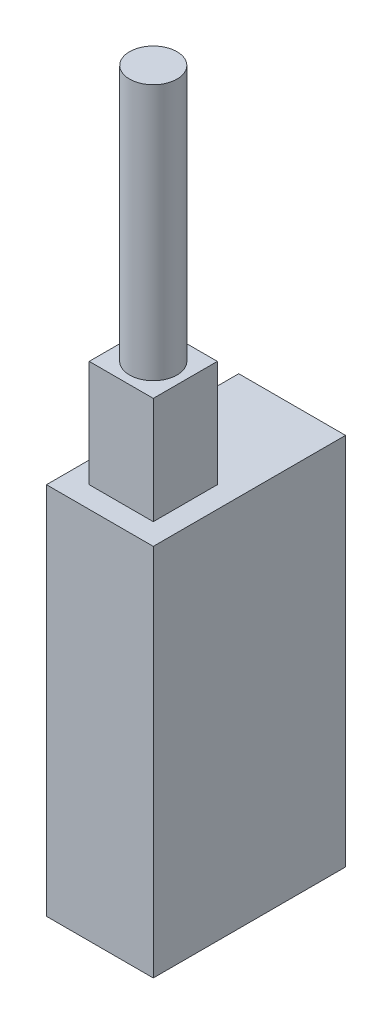
ISO-10303-21;
HEADER;
FILE_DESCRIPTION(('STEP AP214'),'2;1');
FILE_NAME('part.step','',(''),(''),'','','');
FILE_SCHEMA(('AUTOMOTIVE_DESIGN { 1 0 10303 214 1 1 1 1 }'));
ENDSEC;
DATA;
#1=APPLICATION_CONTEXT('core data for automotive mechanical design processes');
#2=APPLICATION_PROTOCOL_DEFINITION('international standard','automotive_design',2000,#1);
#3=PRODUCT_CONTEXT('',#1,'mechanical');
#4=PRODUCT('Part','Part','',(#3));
#5=PRODUCT_RELATED_PRODUCT_CATEGORY('part','',(#4));
#6=PRODUCT_DEFINITION_FORMATION('','',#4);
#7=PRODUCT_DEFINITION_CONTEXT('part definition',#1,'design');
#8=PRODUCT_DEFINITION('design','',#6,#7);
#9=PRODUCT_DEFINITION_SHAPE('','',#8);
#10=(LENGTH_UNIT() NAMED_UNIT(*) SI_UNIT(.MILLI.,.METRE.));
#11=(NAMED_UNIT(*) PLANE_ANGLE_UNIT() SI_UNIT($,.RADIAN.));
#12=(NAMED_UNIT(*) SI_UNIT($,.STERADIAN.) SOLID_ANGLE_UNIT());
#13=UNCERTAINTY_MEASURE_WITH_UNIT(LENGTH_MEASURE(1.E-05),#10,'distance_accuracy_value','');
#14=(GEOMETRIC_REPRESENTATION_CONTEXT(3) GLOBAL_UNCERTAINTY_ASSIGNED_CONTEXT((#13)) GLOBAL_UNIT_ASSIGNED_CONTEXT((#10,
#11,#12)) REPRESENTATION_CONTEXT('',''));
#15=CARTESIAN_POINT('',(0.,0.,0.));
#16=DIRECTION('',(0.,0.,1.));
#17=DIRECTION('',(1.,0.,0.));
#18=AXIS2_PLACEMENT_3D('',#15,#16,#17);
#19=CARTESIAN_POINT('',(0.,70.,0.));
#20=DIRECTION('',(0.,-1.,0.));
#21=DIRECTION('',(0.,0.,-1.));
#22=AXIS2_PLACEMENT_3D('',#19,#20,#21);
#23=PLANE('',#22);
#24=DIRECTION('',(0.,0.,-1.));
#25=VECTOR('',#24,1.);
#26=CARTESIAN_POINT('',(10.,70.,18.));
#27=LINE('',#26,#25);
#28=CARTESIAN_POINT('',(10.,70.,18.));
#29=VERTEX_POINT('',#28);
#30=CARTESIAN_POINT('',(10.,70.,-18.));
#31=VERTEX_POINT('',#30);
#32=EDGE_CURVE('E130',#29,#31,#27,.T.);
#33=ORIENTED_EDGE('',*,*,#32,.T.);
#34=DIRECTION('',(-1.,0.,0.));
#35=VECTOR('',#34,1.);
#36=CARTESIAN_POINT('',(-10.,70.,-18.));
#37=LINE('',#36,#35);
#38=CARTESIAN_POINT('',(-10.,70.,-18.));
#39=VERTEX_POINT('',#38);
#40=EDGE_CURVE('E133',#31,#39,#37,.T.);
#41=ORIENTED_EDGE('',*,*,#40,.T.);
#42=DIRECTION('',(0.,0.,1.));
#43=VECTOR('',#42,1.);
#44=CARTESIAN_POINT('',(-10.,70.,18.));
#45=LINE('',#44,#43);
#46=CARTESIAN_POINT('',(-10.,70.,18.));
#47=VERTEX_POINT('',#46);
#48=EDGE_CURVE('E136',#39,#47,#45,.T.);
#49=ORIENTED_EDGE('',*,*,#48,.T.);
#50=DIRECTION('',(1.,0.,0.));
#51=VECTOR('',#50,1.);
#52=CARTESIAN_POINT('',(-10.,70.,18.));
#53=LINE('',#52,#51);
#54=EDGE_CURVE('E138',#47,#29,#53,.T.);
#55=ORIENTED_EDGE('',*,*,#54,.T.);
#56=EDGE_LOOP('',(#33,#41,#49,#55));
#57=FACE_BOUND('',#56,.T.);
#58=DIRECTION('',(0.,0.,-1.));
#59=VECTOR('',#58,1.);
#60=CARTESIAN_POINT('',(6.,70.,14.));
#61=LINE('',#60,#59);
#62=CARTESIAN_POINT('',(6.,70.,14.));
#63=VERTEX_POINT('',#62);
#64=CARTESIAN_POINT('',(6.,70.,2.));
#65=VERTEX_POINT('',#64);
#66=EDGE_CURVE('E120',#63,#65,#61,.T.);
#67=ORIENTED_EDGE('',*,*,#66,.F.);
#68=DIRECTION('',(1.,0.,0.));
#69=VECTOR('',#68,1.);
#70=CARTESIAN_POINT('',(-6.,70.,14.));
#71=LINE('',#70,#69);
#72=CARTESIAN_POINT('',(-6.,70.,14.));
#73=VERTEX_POINT('',#72);
#74=EDGE_CURVE('E117',#73,#63,#71,.T.);
#75=ORIENTED_EDGE('',*,*,#74,.F.);
#76=DIRECTION('',(0.,0.,1.));
#77=VECTOR('',#76,1.);
#78=CARTESIAN_POINT('',(-6.,70.,14.));
#79=LINE('',#78,#77);
#80=CARTESIAN_POINT('',(-6.,70.,2.));
#81=VERTEX_POINT('',#80);
#82=EDGE_CURVE('E55',#81,#73,#79,.T.);
#83=ORIENTED_EDGE('',*,*,#82,.F.);
#84=DIRECTION('',(-1.,0.,0.));
#85=VECTOR('',#84,1.);
#86=CARTESIAN_POINT('',(-6.,70.,2.));
#87=LINE('',#86,#85);
#88=EDGE_CURVE('E50',#65,#81,#87,.T.);
#89=ORIENTED_EDGE('',*,*,#88,.F.);
#90=EDGE_LOOP('',(#67,#75,#83,#89));
#91=FACE_BOUND('',#90,.T.);
#92=ADVANCED_FACE('F34',(#57,#91),#23,.F.);
#93=CARTESIAN_POINT('',(10.,70.,18.));
#94=DIRECTION('',(-1.,0.,0.));
#95=DIRECTION('',(0.,0.,1.));
#96=AXIS2_PLACEMENT_3D('',#93,#94,#95);
#97=PLANE('',#96);
#98=DIRECTION('',(0.,0.,-1.));
#99=VECTOR('',#98,1.);
#100=CARTESIAN_POINT('',(10.,0.,18.));
#101=LINE('',#100,#99);
#102=CARTESIAN_POINT('',(10.,0.,18.));
#103=VERTEX_POINT('',#102);
#104=CARTESIAN_POINT('',(10.,0.,-18.));
#105=VERTEX_POINT('',#104);
#106=EDGE_CURVE('E121',#103,#105,#101,.T.);
#107=ORIENTED_EDGE('',*,*,#106,.T.);
#108=DIRECTION('',(0.,-1.,0.));
#109=VECTOR('',#108,1.);
#110=CARTESIAN_POINT('',(10.,70.,-18.));
#111=LINE('',#110,#109);
#112=EDGE_CURVE('E38',#31,#105,#111,.T.);
#113=ORIENTED_EDGE('',*,*,#112,.F.);
#114=ORIENTED_EDGE('',*,*,#32,.F.);
#115=DIRECTION('',(0.,-1.,0.));
#116=VECTOR('',#115,1.);
#117=CARTESIAN_POINT('',(10.,70.,18.));
#118=LINE('',#117,#116);
#119=EDGE_CURVE('E139',#29,#103,#118,.T.);
#120=ORIENTED_EDGE('',*,*,#119,.T.);
#121=EDGE_LOOP('',(#107,#113,#114,#120));
#122=FACE_BOUND('',#121,.T.);
#123=ADVANCED_FACE('F36',(#122),#97,.F.);
#124=CARTESIAN_POINT('',(-10.,70.,-18.));
#125=DIRECTION('',(0.,0.,1.));
#126=DIRECTION('',(1.,0.,0.));
#127=AXIS2_PLACEMENT_3D('',#124,#125,#126);
#128=PLANE('',#127);
#129=DIRECTION('',(-1.,0.,0.));
#130=VECTOR('',#129,1.);
#131=CARTESIAN_POINT('',(-10.,0.,-18.));
#132=LINE('',#131,#130);
#133=CARTESIAN_POINT('',(-10.,0.,-18.));
#134=VERTEX_POINT('',#133);
#135=EDGE_CURVE('E124',#105,#134,#132,.T.);
#136=ORIENTED_EDGE('',*,*,#135,.T.);
#137=DIRECTION('',(0.,-1.,0.));
#138=VECTOR('',#137,1.);
#139=CARTESIAN_POINT('',(-10.,70.,-18.));
#140=LINE('',#139,#138);
#141=EDGE_CURVE('E149',#39,#134,#140,.T.);
#142=ORIENTED_EDGE('',*,*,#141,.F.);
#143=ORIENTED_EDGE('',*,*,#40,.F.);
#144=ORIENTED_EDGE('',*,*,#112,.T.);
#145=EDGE_LOOP('',(#136,#142,#143,#144));
#146=FACE_BOUND('',#145,.T.);
#147=ADVANCED_FACE('F158',(#146),#128,.F.);
#148=CARTESIAN_POINT('',(-10.,70.,18.));
#149=DIRECTION('',(1.,0.,0.));
#150=DIRECTION('',(0.,0.,-1.));
#151=AXIS2_PLACEMENT_3D('',#148,#149,#150);
#152=PLANE('',#151);
#153=DIRECTION('',(0.,0.,1.));
#154=VECTOR('',#153,1.);
#155=CARTESIAN_POINT('',(-10.,0.,18.));
#156=LINE('',#155,#154);
#157=CARTESIAN_POINT('',(-10.,0.,18.));
#158=VERTEX_POINT('',#157);
#159=EDGE_CURVE('E142',#134,#158,#156,.T.);
#160=ORIENTED_EDGE('',*,*,#159,.T.);
#161=DIRECTION('',(0.,-1.,0.));
#162=VECTOR('',#161,1.);
#163=CARTESIAN_POINT('',(-10.,70.,18.));
#164=LINE('',#163,#162);
#165=EDGE_CURVE('E147',#47,#158,#164,.T.);
#166=ORIENTED_EDGE('',*,*,#165,.F.);
#167=ORIENTED_EDGE('',*,*,#48,.F.);
#168=ORIENTED_EDGE('',*,*,#141,.T.);
#169=EDGE_LOOP('',(#160,#166,#167,#168));
#170=FACE_BOUND('',#169,.T.);
#171=ADVANCED_FACE('F167',(#170),#152,.F.);
#172=CARTESIAN_POINT('',(-10.,70.,18.));
#173=DIRECTION('',(0.,0.,-1.));
#174=DIRECTION('',(-1.,0.,0.));
#175=AXIS2_PLACEMENT_3D('',#172,#173,#174);
#176=PLANE('',#175);
#177=DIRECTION('',(1.,0.,0.));
#178=VECTOR('',#177,1.);
#179=CARTESIAN_POINT('',(-10.,0.,18.));
#180=LINE('',#179,#178);
#181=EDGE_CURVE('E134',#158,#103,#180,.T.);
#182=ORIENTED_EDGE('',*,*,#181,.T.);
#183=ORIENTED_EDGE('',*,*,#119,.F.);
#184=ORIENTED_EDGE('',*,*,#54,.F.);
#185=ORIENTED_EDGE('',*,*,#165,.T.);
#186=EDGE_LOOP('',(#182,#183,#184,#185));
#187=FACE_BOUND('',#186,.T.);
#188=ADVANCED_FACE('F170',(#187),#176,.F.);
#189=CARTESIAN_POINT('',(0.,0.,0.));
#190=DIRECTION('',(0.,-1.,0.));
#191=DIRECTION('',(0.,0.,-1.));
#192=AXIS2_PLACEMENT_3D('',#189,#190,#191);
#193=PLANE('',#192);
#194=ORIENTED_EDGE('',*,*,#106,.F.);
#195=ORIENTED_EDGE('',*,*,#181,.F.);
#196=ORIENTED_EDGE('',*,*,#159,.F.);
#197=ORIENTED_EDGE('',*,*,#135,.F.);
#198=EDGE_LOOP('',(#194,#195,#196,#197));
#199=FACE_BOUND('',#198,.T.);
#200=ADVANCED_FACE('F165',(#199),#193,.T.);
#201=CARTESIAN_POINT('',(6.,90.,14.));
#202=DIRECTION('',(-1.,0.,0.));
#203=DIRECTION('',(0.,0.,1.));
#204=AXIS2_PLACEMENT_3D('',#201,#202,#203);
#205=PLANE('',#204);
#206=ORIENTED_EDGE('',*,*,#66,.T.);
#207=DIRECTION('',(0.,-1.,0.));
#208=VECTOR('',#207,1.);
#209=CARTESIAN_POINT('',(6.,90.,2.));
#210=LINE('',#209,#208);
#211=CARTESIAN_POINT('',(6.,90.,2.));
#212=VERTEX_POINT('',#211);
#213=EDGE_CURVE('E101',#212,#65,#210,.T.);
#214=ORIENTED_EDGE('',*,*,#213,.F.);
#215=DIRECTION('',(0.,0.,-1.));
#216=VECTOR('',#215,1.);
#217=CARTESIAN_POINT('',(6.,90.,14.));
#218=LINE('',#217,#216);
#219=CARTESIAN_POINT('',(6.,90.,14.));
#220=VERTEX_POINT('',#219);
#221=EDGE_CURVE('E108',#220,#212,#218,.T.);
#222=ORIENTED_EDGE('',*,*,#221,.F.);
#223=DIRECTION('',(0.,-1.,0.));
#224=VECTOR('',#223,1.);
#225=CARTESIAN_POINT('',(6.,90.,14.));
#226=LINE('',#225,#224);
#227=EDGE_CURVE('E180',#220,#63,#226,.T.);
#228=ORIENTED_EDGE('',*,*,#227,.T.);
#229=EDGE_LOOP('',(#206,#214,#222,#228));
#230=FACE_BOUND('',#229,.T.);
#231=ADVANCED_FACE('F119',(#230),#205,.F.);
#232=CARTESIAN_POINT('',(-6.,90.,2.));
#233=DIRECTION('',(0.,0.,1.));
#234=DIRECTION('',(1.,0.,0.));
#235=AXIS2_PLACEMENT_3D('',#232,#233,#234);
#236=PLANE('',#235);
#237=ORIENTED_EDGE('',*,*,#88,.T.);
#238=DIRECTION('',(0.,-1.,0.));
#239=VECTOR('',#238,1.);
#240=CARTESIAN_POINT('',(-6.,90.,2.));
#241=LINE('',#240,#239);
#242=CARTESIAN_POINT('',(-6.,90.,2.));
#243=VERTEX_POINT('',#242);
#244=EDGE_CURVE('E104',#243,#81,#241,.T.);
#245=ORIENTED_EDGE('',*,*,#244,.F.);
#246=DIRECTION('',(-1.,0.,0.));
#247=VECTOR('',#246,1.);
#248=CARTESIAN_POINT('',(-6.,90.,2.));
#249=LINE('',#248,#247);
#250=EDGE_CURVE('E97',#212,#243,#249,.T.);
#251=ORIENTED_EDGE('',*,*,#250,.F.);
#252=ORIENTED_EDGE('',*,*,#213,.T.);
#253=EDGE_LOOP('',(#237,#245,#251,#252));
#254=FACE_BOUND('',#253,.T.);
#255=ADVANCED_FACE('F99',(#254),#236,.F.);
#256=CARTESIAN_POINT('',(-6.,90.,14.));
#257=DIRECTION('',(1.,0.,0.));
#258=DIRECTION('',(0.,0.,-1.));
#259=AXIS2_PLACEMENT_3D('',#256,#257,#258);
#260=PLANE('',#259);
#261=ORIENTED_EDGE('',*,*,#82,.T.);
#262=DIRECTION('',(0.,-1.,0.));
#263=VECTOR('',#262,1.);
#264=CARTESIAN_POINT('',(-6.,90.,14.));
#265=LINE('',#264,#263);
#266=CARTESIAN_POINT('',(-6.,90.,14.));
#267=VERTEX_POINT('',#266);
#268=EDGE_CURVE('E126',#267,#73,#265,.T.);
#269=ORIENTED_EDGE('',*,*,#268,.F.);
#270=DIRECTION('',(0.,0.,1.));
#271=VECTOR('',#270,1.);
#272=CARTESIAN_POINT('',(-6.,90.,14.));
#273=LINE('',#272,#271);
#274=EDGE_CURVE('E107',#243,#267,#273,.T.);
#275=ORIENTED_EDGE('',*,*,#274,.F.);
#276=ORIENTED_EDGE('',*,*,#244,.T.);
#277=EDGE_LOOP('',(#261,#269,#275,#276));
#278=FACE_BOUND('',#277,.T.);
#279=ADVANCED_FACE('F205',(#278),#260,.F.);
#280=CARTESIAN_POINT('',(-6.,90.,14.));
#281=DIRECTION('',(0.,0.,-1.));
#282=DIRECTION('',(-1.,0.,0.));
#283=AXIS2_PLACEMENT_3D('',#280,#281,#282);
#284=PLANE('',#283);
#285=ORIENTED_EDGE('',*,*,#74,.T.);
#286=ORIENTED_EDGE('',*,*,#227,.F.);
#287=DIRECTION('',(1.,0.,0.));
#288=VECTOR('',#287,1.);
#289=CARTESIAN_POINT('',(-6.,90.,14.));
#290=LINE('',#289,#288);
#291=EDGE_CURVE('E113',#267,#220,#290,.T.);
#292=ORIENTED_EDGE('',*,*,#291,.F.);
#293=ORIENTED_EDGE('',*,*,#268,.T.);
#294=EDGE_LOOP('',(#285,#286,#292,#293));
#295=FACE_BOUND('',#294,.T.);
#296=ADVANCED_FACE('F179',(#295),#284,.F.);
#297=CARTESIAN_POINT('',(0.,90.,0.));
#298=DIRECTION('',(0.,-1.,0.));
#299=DIRECTION('',(0.,0.,-1.));
#300=AXIS2_PLACEMENT_3D('',#297,#298,#299);
#301=PLANE('',#300);
#302=CARTESIAN_POINT('',(0.,90.,8.));
#303=DIRECTION('',(0.,1.,0.));
#304=DIRECTION('',(0.,0.,1.));
#305=AXIS2_PLACEMENT_3D('',#302,#303,#304);
#306=CIRCLE('',#305,4.445);
#307=CARTESIAN_POINT('',(0.,90.,12.445));
#308=VERTEX_POINT('',#307);
#309=EDGE_CURVE('E11',#308,#308,#306,.T.);
#310=ORIENTED_EDGE('',*,*,#309,.F.);
#311=EDGE_LOOP('',(#310));
#312=FACE_BOUND('',#311,.T.);
#313=ORIENTED_EDGE('',*,*,#221,.T.);
#314=ORIENTED_EDGE('',*,*,#250,.T.);
#315=ORIENTED_EDGE('',*,*,#274,.T.);
#316=ORIENTED_EDGE('',*,*,#291,.T.);
#317=EDGE_LOOP('',(#313,#314,#315,#316));
#318=FACE_BOUND('',#317,.T.);
#319=ADVANCED_FACE('F111',(#312,#318),#301,.F.);
#320=CARTESIAN_POINT('',(0.,138.,8.));
#321=DIRECTION('',(0.,-1.,0.));
#322=DIRECTION('',(0.,0.,-1.));
#323=AXIS2_PLACEMENT_3D('',#320,#321,#322);
#324=CYLINDRICAL_SURFACE('',#323,4.445);
#325=CARTESIAN_POINT('',(0.,138.,8.));
#326=DIRECTION('',(0.,1.,0.));
#327=DIRECTION('',(0.,0.,1.));
#328=AXIS2_PLACEMENT_3D('',#325,#326,#327);
#329=CIRCLE('',#328,4.445);
#330=CARTESIAN_POINT('',(0.,138.,12.445));
#331=VERTEX_POINT('',#330);
#332=EDGE_CURVE('E175',#331,#331,#329,.T.);
#333=ORIENTED_EDGE('',*,*,#332,.F.);
#334=EDGE_LOOP('',(#333));
#335=FACE_BOUND('',#334,.T.);
#336=ORIENTED_EDGE('',*,*,#309,.T.);
#337=EDGE_LOOP('',(#336));
#338=FACE_BOUND('',#337,.T.);
#339=ADVANCED_FACE('F194',(#335,#338),#324,.T.);
#340=CARTESIAN_POINT('',(0.,138.,8.));
#341=DIRECTION('',(0.,1.,0.));
#342=DIRECTION('',(0.,0.,1.));
#343=AXIS2_PLACEMENT_3D('',#340,#341,#342);
#344=PLANE('',#343);
#345=ORIENTED_EDGE('',*,*,#332,.T.);
#346=EDGE_LOOP('',(#345));
#347=FACE_BOUND('',#346,.T.);
#348=ADVANCED_FACE('F192',(#347),#344,.T.);
#349=CLOSED_SHELL('',(#92,#123,#147,#171,#188,#200,#231,#255,#279,#296,#319,#339,#348));
#350=MANIFOLD_SOLID_BREP('B2',#349);
#351=ADVANCED_BREP_SHAPE_REPRESENTATION('',(#18,#350),#14);
#352=SHAPE_DEFINITION_REPRESENTATION(#9,#351);
ENDSEC;
END-ISO-10303-21;
